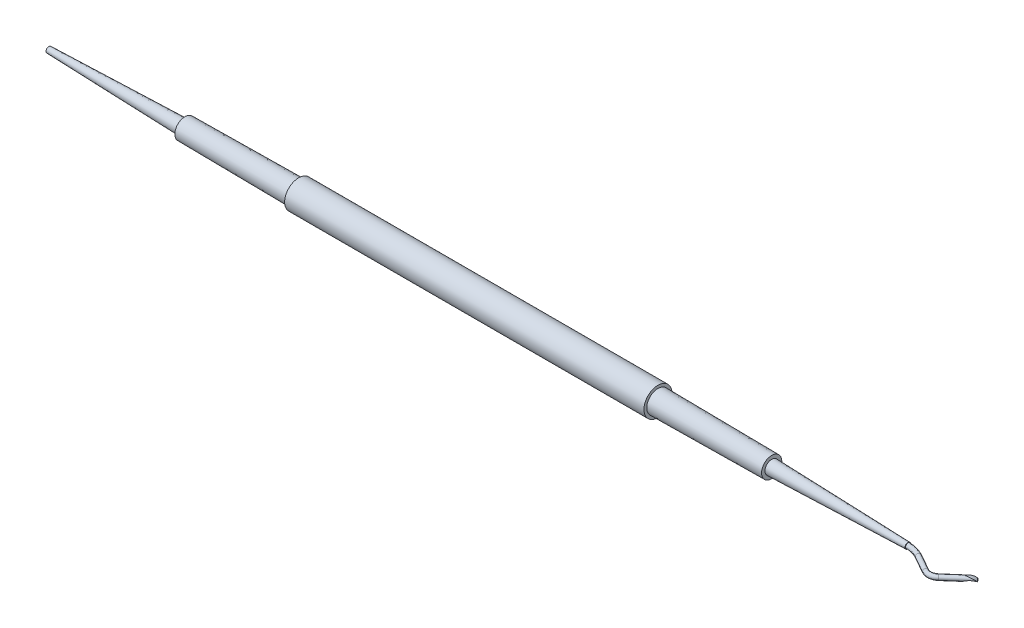
ISO-10303-21;
HEADER;
FILE_DESCRIPTION(('STEP AP214'),'2;1');
FILE_NAME('part.step','',(''),(''),'','','');
FILE_SCHEMA(('AUTOMOTIVE_DESIGN { 1 0 10303 214 1 1 1 1 }'));
ENDSEC;
DATA;
#1=APPLICATION_CONTEXT('core data for automotive mechanical design processes');
#2=APPLICATION_PROTOCOL_DEFINITION('international standard','automotive_design',2000,#1);
#3=PRODUCT_CONTEXT('',#1,'mechanical');
#4=PRODUCT('Part','Part','',(#3));
#5=PRODUCT_RELATED_PRODUCT_CATEGORY('part','',(#4));
#6=PRODUCT_DEFINITION_FORMATION('','',#4);
#7=PRODUCT_DEFINITION_CONTEXT('part definition',#1,'design');
#8=PRODUCT_DEFINITION('design','',#6,#7);
#9=PRODUCT_DEFINITION_SHAPE('','',#8);
#10=(LENGTH_UNIT() NAMED_UNIT(*) SI_UNIT(.MILLI.,.METRE.));
#11=(NAMED_UNIT(*) PLANE_ANGLE_UNIT() SI_UNIT($,.RADIAN.));
#12=(NAMED_UNIT(*) SI_UNIT($,.STERADIAN.) SOLID_ANGLE_UNIT());
#13=UNCERTAINTY_MEASURE_WITH_UNIT(LENGTH_MEASURE(1.E-05),#10,'distance_accuracy_value','');
#14=(GEOMETRIC_REPRESENTATION_CONTEXT(3) GLOBAL_UNCERTAINTY_ASSIGNED_CONTEXT((#13)) GLOBAL_UNIT_ASSIGNED_CONTEXT((#10,
#11,#12)) REPRESENTATION_CONTEXT('',''));
#15=CARTESIAN_POINT('',(0.,0.,0.));
#16=DIRECTION('',(0.,0.,1.));
#17=DIRECTION('',(1.,0.,0.));
#18=AXIS2_PLACEMENT_3D('',#15,#16,#17);
#19=CARTESIAN_POINT('',(63.6969930566618,0.,-30.1608804847367));
#20=DIRECTION('',(0.707106781186546,5.9604644836623E-08,-0.707106781186546));
#21=DIRECTION('',(-0.707106781186548,0.,-0.707106781186548));
#22=AXIS2_PLACEMENT_3D('',#19,#20,#21);
#23=CIRCLE('',#22,0.425000000000001);
#24=DIRECTION('',(0.752843126221306,0.,-0.658199990353487));
#25=VECTOR('',#24,1.);
#26=SURFACE_OF_LINEAR_EXTRUSION('',#23,#25);
#27=CARTESIAN_POINT('',(63.3964726746575,0.,-30.4614008667409));
#28=VERTEX_POINT('',#27);
#29=EDGE_CURVE('E175',#28,#28,#23,.T.);
#30=ORIENTED_EDGE('',*,*,#29,.T.);
#31=EDGE_LOOP('',(#30));
#32=FACE_BOUND('',#31,.T.);
#33=CARTESIAN_POINT('',(67.6511873969928,-0.258658752841257,-33.1710451259865));
#34=CARTESIAN_POINT('',(67.6528045494839,-0.24429116295213,-33.1579142887532));
#35=CARTESIAN_POINT('',(67.6535727690092,-0.229456959110943,-33.1453880770501));
#36=CARTESIAN_POINT('',(67.653411342128,-0.198855323524447,-33.1215449047044));
#37=CARTESIAN_POINT('',(67.6524816957216,-0.183087891779138,-33.1102279440617));
#38=CARTESIAN_POINT('',(67.6507031163494,-0.166853846081768,-33.0995156089493));
#39=B_SPLINE_CURVE_WITH_KNOTS('',3,(#33,#34,#35,#36,#37,#38),.UNSPECIFIED.,.F.,.F.,(4,2,4),(0.,
0.0582919179667387,0.116583835933478),.UNSPECIFIED.);
#40=CARTESIAN_POINT('',(67.6511873969928,-0.258658752841257,-33.1710451259865));
#41=VERTEX_POINT('',#40);
#42=CARTESIAN_POINT('',(67.6507031163494,-0.166853846081765,-33.0995156089493));
#43=VERTEX_POINT('',#42);
#44=EDGE_CURVE('E48',#41,#43,#39,.T.);
#45=ORIENTED_EDGE('',*,*,#44,.T.);
#46=CARTESIAN_POINT('',(67.6507031163494,-0.166853846081757,-33.0995156089493));
#47=CARTESIAN_POINT('',(67.6437455442857,-0.156078227115985,-33.08733965316));
#48=CARTESIAN_POINT('',(67.6362743139802,-0.145346648935356,-33.07543088082));
#49=CARTESIAN_POINT('',(67.6204099658853,-0.124034160674299,-33.0521217833227));
#50=CARTESIAN_POINT('',(67.6120175476423,-0.113453143063015,-33.0407210814638));
#51=CARTESIAN_POINT('',(67.5875937174699,-0.0843793389244943,-33.0097447208781));
#52=CARTESIAN_POINT('',(67.5706749068561,-0.0660976993231702,-32.990667082251));
#53=CARTESIAN_POINT('',(67.5346907839806,-0.0303530884627027,-32.953796697354));
#54=CARTESIAN_POINT('',(67.5156235172787,-0.0128908834262404,-32.9360051455755));
#55=CARTESIAN_POINT('',(67.4558715775179,0.0379787119219545,-32.8844072292486));
#56=CARTESIAN_POINT('',(67.4125398571444,0.0699805907076151,-32.8522626271264));
#57=CARTESIAN_POINT('',(67.3210207243787,0.129735904654552,-32.7913984281136));
#58=CARTESIAN_POINT('',(67.2728372215585,0.15749271577668,-32.7626761136504));
#59=CARTESIAN_POINT('',(67.1729461661692,0.208757610183487,-32.7077879807982));
#60=CARTESIAN_POINT('',(67.1212401551242,0.232267535755102,-32.6816210561623));
#61=CARTESIAN_POINT('',(67.0152664141436,0.275107483525564,-32.6312127860484));
#62=CARTESIAN_POINT('',(66.9609993363274,0.294438562854347,-32.6069709545602));
#63=CARTESIAN_POINT('',(66.8506006968685,0.329027529275209,-32.5599202414545));
#64=CARTESIAN_POINT('',(66.7944694239258,0.344286043791555,-32.5371111395235));
#65=CARTESIAN_POINT('',(66.6808786659113,0.370828459307692,-32.4925549487387));
#66=CARTESIAN_POINT('',(66.6234193071219,0.382112736559233,-32.4708077595188));
#67=CARTESIAN_POINT('',(66.5062091594492,0.401011375293602,-32.4275514743997));
#68=CARTESIAN_POINT('',(66.4464364163068,0.408531676929487,-32.4060604617622));
#69=CARTESIAN_POINT('',(66.3679282345576,0.41572425609031,-32.3785891610623));
#70=CARTESIAN_POINT('',(66.3494924808867,0.417221578234038,-32.3721921573082));
#71=CARTESIAN_POINT('',(66.3125454844976,0.419839639900346,-32.3595421650755));
#72=CARTESIAN_POINT('',(66.2940342456117,0.420960398306228,-32.3532891693901));
#73=CARTESIAN_POINT('',(66.2636425512783,0.42248601501354,-32.3433443001972));
#74=CARTESIAN_POINT('',(66.2518026655252,0.423002942848195,-32.3395491143053));
#75=CARTESIAN_POINT('',(66.2323990359157,0.42372120317685,-32.3336754765893));
#76=CARTESIAN_POINT('',(66.2248715356617,0.423968575195228,-32.3314807946055));
#77=CARTESIAN_POINT('',(66.2123507132798,0.424326063527001,-32.3281683299119));
#78=CARTESIAN_POINT('',(66.2073905551131,0.424453942341993,-32.3269421468421));
#79=CARTESIAN_POINT('',(66.1990931601383,0.424643061234417,-32.3252475693451));
#80=CARTESIAN_POINT('',(66.1957766236008,0.424712186131435,-32.324663234684));
#81=CARTESIAN_POINT('',(66.1891855006548,0.424834964550152,-32.3238696410187));
#82=CARTESIAN_POINT('',(66.1859140974136,0.424889105592861,-32.323646991518));
#83=CARTESIAN_POINT('',(66.1814748726344,0.424948121658036,-32.3241494061104));
#84=CARTESIAN_POINT('',(66.1802669068749,0.424962669605739,-32.324370237));
#85=CARTESIAN_POINT('',(66.1779226235479,0.424986089391464,-32.3251535324298));
#86=CARTESIAN_POINT('',(66.1767872134721,0.424994898672586,-32.3257196359968));
#87=CARTESIAN_POINT('',(66.1751563812516,0.425000793818929,-32.3270949986066));
#88=CARTESIAN_POINT('',(66.1745707888271,0.425000460160245,-32.3277927311136));
#89=CARTESIAN_POINT('',(66.1736673073348,0.424994359684992,-32.3293328655104));
#90=CARTESIAN_POINT('',(66.1733484062992,0.424988613584307,-32.3301747057859));
#91=CARTESIAN_POINT('',(66.1727155492817,0.42496713263638,-32.3326515426011));
#92=CARTESIAN_POINT('',(66.172648457182,0.424947056848973,-32.3343379718675));
#93=CARTESIAN_POINT('',(66.1728723287709,0.424877894302242,-32.3394063916986));
#94=CARTESIAN_POINT('',(66.1736066208746,0.424820308891583,-32.3427335956496));
#95=CARTESIAN_POINT('',(66.1754001750184,0.424691350473712,-32.3493117416951));
#96=CARTESIAN_POINT('',(66.1764627017238,0.424619841751555,-32.3525615474696));
#97=CARTESIAN_POINT('',(66.1798451387075,0.424389906937479,-32.3620948741987));
#98=CARTESIAN_POINT('',(66.1823935459102,0.42421390184582,-32.3682983355549));
#99=CARTESIAN_POINT('',(66.187683162078,0.423817070036864,-32.3806211981264));
#100=CARTESIAN_POINT('',(66.1904246135467,0.42359618626183,-32.3867404816386));
#101=CARTESIAN_POINT('',(66.1959969041315,0.423111527548993,-32.3988896795957));
#102=CARTESIAN_POINT('',(66.1988270402961,0.422848042969012,-32.4049199168643));
#103=CARTESIAN_POINT('',(66.2045443914714,0.422277550581856,-32.4169460955671));
#104=CARTESIAN_POINT('',(66.2074315715549,0.421970568737712,-32.4229420552562));
#105=CARTESIAN_POINT('',(66.2219631619519,0.420325503979314,-32.4528953249947));
#106=CARTESIAN_POINT('',(66.2338650061401,0.418659760019526,-32.4767107237203));
#107=CARTESIAN_POINT('',(66.2578395314483,0.414627654725028,-32.5242035675893));
#108=CARTESIAN_POINT('',(66.2699122693541,0.412261055041607,-32.5478809630024));
#109=CARTESIAN_POINT('',(66.2942088179677,0.406819375520685,-32.5951311620099));
#110=CARTESIAN_POINT('',(66.3064328597344,0.40374303949088,-32.6187037037108));
#111=CARTESIAN_POINT('',(66.3309943941912,0.396880683550806,-32.6656818919974));
#112=CARTESIAN_POINT('',(66.3433318762392,0.393094729578351,-32.6890875538801));
#113=CARTESIAN_POINT('',(66.3804659430073,0.38068550605793,-32.7588984901474));
#114=CARTESIAN_POINT('',(66.4054478021747,0.370996653728389,-32.8050218097191));
#115=CARTESIAN_POINT('',(66.4560308067797,0.348725398149464,-32.8962219659259));
#116=CARTESIAN_POINT('',(66.4816319822873,0.336142854147587,-32.9412987515388));
#117=CARTESIAN_POINT('',(66.5337036377941,0.307989507963047,-33.0301650803742));
#118=CARTESIAN_POINT('',(66.5601761406788,0.292411275751515,-33.0739511040906));
#119=CARTESIAN_POINT('',(66.6141500341152,0.258227406575446,-33.159665137125));
#120=CARTESIAN_POINT('',(66.6416512223902,0.239622362406729,-33.2015935082193));
#121=CARTESIAN_POINT('',(66.6979116412786,0.199368026463909,-33.2829544007512));
#122=CARTESIAN_POINT('',(66.72666831356,0.177724743033453,-33.3223916306471));
#123=CARTESIAN_POINT('',(66.7858422184484,0.131341943507186,-33.3981218761712));
#124=CARTESIAN_POINT('',(66.8162599087895,0.10660157148021,-33.4344140178924));
#125=CARTESIAN_POINT('',(66.8791911294972,0.0540883064027667,-33.5028364489158));
#126=CARTESIAN_POINT('',(66.9117056257442,0.0263140116479241,-33.534964799387));
#127=CARTESIAN_POINT('',(66.9749562987444,-0.0281961748381158,-33.5897805263988));
#128=CARTESIAN_POINT('',(67.0053752170644,-0.0545986506160452,-33.6131520876014));
#129=CARTESIAN_POINT('',(67.0530307302808,-0.09562398207578,-33.6441524944955));
#130=CARTESIAN_POINT('',(67.0694075219606,-0.109666427796053,-33.6538770488798));
#131=CARTESIAN_POINT('',(67.1028395377284,-0.138061412966175,-33.6716378723126));
#132=CARTESIAN_POINT('',(67.11989571802,-0.152414375476507,-33.6796716540989));
#133=CARTESIAN_POINT('',(67.137306241785,-0.166853846081759,-33.6867342563268));
#134=B_SPLINE_CURVE_WITH_KNOTS('',3,(#46,#47,#48,#49,#50,#51,#52,#53,#54,#55,#56,#57,#58,#59,
#60,#61,#62,#63,#64,#65,#66,#67,#68,#69,#70,#71,#72,#73,#74,#75,#76,#77,#78,#79,#80,#81,#82,#83,
#84,#85,#86,#87,#88,#89,#90,#91,#92,#93,#94,#95,#96,#97,#98,#99,#100,#101,#102,#103,#104,#105,
#106,#107,#108,#109,#110,#111,#112,#113,#114,#115,#116,#117,#118,#119,#120,#121,#122,#123,#124,
#125,#126,#127,#128,#129,#130,#131,#132,#133),.UNSPECIFIED.,.F.,.F.,(4,2,2,2,2,2,2,2,2,2,2,2,2,
2,2,2,2,2,2,2,2,2,2,2,2,2,2,2,2,2,2,2,2,2,2,2,2,2,2,2,2,2,2,4),(0.,0.0530330355999665,
0.106026073177627,0.200010813964857,0.294081753204683,0.481667918282324,0.669104117794824,
0.856458811727566,1.04376605461255,1.23104442403847,1.41830505854752,1.61003691416296,
1.66874862900401,1.72745739922639,1.76478323653067,1.78831905059973,1.80363450989081,
1.81375060771837,1.82348286278468,1.82714866496847,1.83085378731138,1.8335277001599,
1.83619142013251,1.84117821033633,1.85133505623803,1.8615963660805,1.88170022115322,
1.90182979757174,1.92182754977982,1.94181341544612,2.02182594460916,2.10186571593596,
2.18204825486523,2.26222334691014,2.42215353645507,2.58209150683444,2.74243140116676,
2.90273993093132,3.06273579142086,3.22277596741169,3.38289039891325,3.52221527905958,
3.5931408208341,3.66416998151407),.UNSPECIFIED.);
#135=CARTESIAN_POINT('',(67.137306241785,-0.166853846081765,-33.6867342563268));
#136=VERTEX_POINT('',#135);
#137=EDGE_CURVE('E11',#43,#136,#134,.T.);
#138=ORIENTED_EDGE('',*,*,#137,.T.);
#139=CARTESIAN_POINT('',(67.137306241785,-0.166853846081765,-33.6867342563268));
#140=CARTESIAN_POINT('',(67.1481601443111,-0.183087891771699,-33.6870663198518));
#141=CARTESIAN_POINT('',(67.1594998853307,-0.198855323513189,-33.6864763095287));
#142=CARTESIAN_POINT('',(67.1831510443566,-0.229456959099287,-33.6834521411864));
#143=CARTESIAN_POINT('',(67.195462462363,-0.244291162943894,-33.6810179831672));
#144=CARTESIAN_POINT('',(67.2082597188628,-0.258658752840058,-33.6776617512999));
#145=B_SPLINE_CURVE_WITH_KNOTS('',3,(#139,#140,#141,#142,#143,#144),.UNSPECIFIED.,.F.,.F.,(4,2,
4),(0.,0.0582919177986592,0.116583835597326),.UNSPECIFIED.);
#146=CARTESIAN_POINT('',(67.2082597188621,-0.258658752841257,-33.6776617512993));
#147=VERTEX_POINT('',#146);
#148=EDGE_CURVE('E95',#136,#147,#145,.T.);
#149=ORIENTED_EDGE('',*,*,#148,.T.);
#150=CARTESIAN_POINT('',(67.2082597188626,-0.258658752841215,-33.6776617512987));
#151=CARTESIAN_POINT('',(67.1802820012183,-0.245570495625067,-33.6664479209341));
#152=CARTESIAN_POINT('',(67.152771234666,-0.232928934422802,-33.6537098257842));
#153=CARTESIAN_POINT('',(67.0985946905032,-0.208753178425956,-33.625853853145));
#154=CARTESIAN_POINT('',(67.0719265347801,-0.197215637115919,-33.6107435594707));
#155=CARTESIAN_POINT('',(67.0052884862757,-0.169629940565738,-33.5703088847398));
#156=CARTESIAN_POINT('',(66.9657061785008,-0.15440439226653,-33.5437948069971));
#157=CARTESIAN_POINT('',(66.8873210973976,-0.127074523450579,-33.4879745468059));
#158=CARTESIAN_POINT('',(66.8485204574919,-0.114977895252638,-33.4586617212457));
#159=CARTESIAN_POINT('',(66.7711599088592,-0.0940022735049208,-33.3980789908946));
#160=CARTESIAN_POINT('',(66.7326032636704,-0.0851449739298108,-33.3667974785005));
#161=CARTESIAN_POINT('',(66.6557414659007,-0.0708179745754755,-33.3031420228818));
#162=CARTESIAN_POINT('',(66.6174364230336,-0.0653496666439142,-33.2707676365655));
#163=CARTESIAN_POINT('',(66.5410209775717,-0.0578366256922296,-33.205417244065));
#164=CARTESIAN_POINT('',(66.5029105301574,-0.0557910652641313,-33.1724413852286));
#165=CARTESIAN_POINT('',(66.4269694700037,-0.0551310684600747,-33.106161475021));
#166=CARTESIAN_POINT('',(66.3891387723274,-0.0565155438303682,-33.0728575310812));
#167=CARTESIAN_POINT('',(66.3067945706879,-0.0632993399987038,-32.9995950860713));
#168=CARTESIAN_POINT('',(66.2623868885887,-0.0694159464142125,-32.9595821945022));
#169=CARTESIAN_POINT('',(66.1750515064675,-0.0864580434115003,-32.8790154819311));
#170=CARTESIAN_POINT('',(66.1321227571341,-0.0973800454726768,-32.8384620739934));
#171=CARTESIAN_POINT('',(66.0637470241865,-0.119180382665745,-32.7708847367859));
#172=CARTESIAN_POINT('',(66.0375270206458,-0.128684226637528,-32.7441954607835));
#173=CARTESIAN_POINT('',(65.9866359410563,-0.149564266150504,-32.6901168330276));
#174=CARTESIAN_POINT('',(65.9619636384875,-0.160938952518723,-32.662728060466));
#175=CARTESIAN_POINT('',(65.9141966352896,-0.185735848511297,-32.6063023214763));
#176=CARTESIAN_POINT('',(65.8911490898595,-0.19919789163293,-32.5772422678051));
#177=CARTESIAN_POINT('',(65.8588658842258,-0.220625011124829,-32.5325200233485));
#178=CARTESIAN_POINT('',(65.848472883833,-0.227984529871102,-32.5174013662388));
#179=CARTESIAN_POINT('',(65.8286102466047,-0.243064632599637,-32.4867269959797));
#180=CARTESIAN_POINT('',(65.8191412781775,-0.250785472060949,-32.4711709767848));
#181=CARTESIAN_POINT('',(65.8102148753809,-0.258658752841249,-32.4553711167116));
#182=B_SPLINE_CURVE_WITH_KNOTS('',3,(#150,#151,#152,#153,#154,#155,#156,#157,#158,#159,#160,
#161,#162,#163,#164,#165,#166,#167,#168,#169,#170,#171,#172,#173,#174,#175,#176,#177,#178,#179,
#180,#181),.UNSPECIFIED.,.F.,.F.,(4,2,2,2,2,2,2,2,2,2,2,2,2,2,2,4),(0.,0.0984586315110298,
0.196608675093287,0.346424599443237,0.496605412468146,0.647774335110639,0.799005301258977,
0.9501997038587,1.10134614287648,1.28140305838815,1.46132947507233,1.57706667843567,
1.69271097263077,1.81092139927881,1.8701972529889,1.92951567153437),.UNSPECIFIED.);
#183=CARTESIAN_POINT('',(65.8102148753789,-0.258658752841257,-32.4553711167139));
#184=VERTEX_POINT('',#183);
#185=EDGE_CURVE('E84',#147,#184,#182,.T.);
#186=ORIENTED_EDGE('',*,*,#185,.T.);
#187=CARTESIAN_POINT('',(66.2900205884006,0.0674437386742544,-32.9840509806894));
#188=CARTESIAN_POINT('',(66.2643997822545,0.0527406776402467,-32.9647753499176));
#189=CARTESIAN_POINT('',(66.2392572877631,0.0380179738631719,-32.9448877289413));
#190=CARTESIAN_POINT('',(66.1899604255579,0.00855793825302269,-32.9039339439726));
#191=CARTESIAN_POINT('',(66.1658060489455,-0.00617939344709588,-32.8828677905974));
#192=CARTESIAN_POINT('',(66.0948363621088,-0.0503987428245335,-32.8179368447281));
#193=CARTESIAN_POINT('',(66.0495528481736,-0.0798660859064056,-32.7723684840827));
#194=CARTESIAN_POINT('',(65.9637472764439,-0.138524835060358,-32.6766973779446));
#195=CARTESIAN_POINT('',(65.9232265166547,-0.167716163925588,-32.6265934029051));
#196=CARTESIAN_POINT('',(65.8672156689508,-0.210983061157589,-32.5476996767273));
#197=CARTESIAN_POINT('',(65.8493275668627,-0.22533037593558,-32.520754873225));
#198=CARTESIAN_POINT('',(65.8155305379099,-0.253749559447364,-32.4655116066498));
#199=CARTESIAN_POINT('',(65.7996208546331,-0.267821531708544,-32.4372136666885));
#200=CARTESIAN_POINT('',(65.7703732126167,-0.29551805495409,-32.3791545991734));
#201=CARTESIAN_POINT('',(65.7570315929455,-0.309143219537263,-32.3493956315639));
#202=CARTESIAN_POINT('',(65.7338395709497,-0.335711879623463,-32.2881367808883));
#203=CARTESIAN_POINT('',(65.7239926978349,-0.348654674864151,-32.2566351748855));
#204=CARTESIAN_POINT('',(65.7122411175268,-0.36889849744288,-32.203188786204));
#205=CARTESIAN_POINT('',(65.7087631039807,-0.376589332624566,-32.1817555704411));
#206=CARTESIAN_POINT('',(65.70505406464,-0.391014155183455,-32.1383367907528));
#207=CARTESIAN_POINT('',(65.7048121490201,-0.397751276137085,-32.1163533288406));
#208=CARTESIAN_POINT('',(65.7092374067538,-0.410019190209617,-32.0707572691874));
#209=CARTESIAN_POINT('',(65.7142199457168,-0.415445102257521,-32.0471304973399));
#210=CARTESIAN_POINT('',(65.727368871278,-0.421147640296118,-32.013249085589));
#211=CARTESIAN_POINT('',(65.7327603495666,-0.42264424115994,-32.0021374339362));
#212=CARTESIAN_POINT('',(65.7455467762826,-0.424605743217495,-31.9810314250443));
#213=CARTESIAN_POINT('',(65.7529381911805,-0.425072450857632,-31.9710351407333));
#214=CARTESIAN_POINT('',(65.7682747598701,-0.424920644512247,-31.9539948980804));
#215=CARTESIAN_POINT('',(65.7759815758156,-0.424450602347291,-31.9467329817304));
#216=CARTESIAN_POINT('',(65.7923937396488,-0.422765058893588,-31.9335301134082));
#217=CARTESIAN_POINT('',(65.8011008786003,-0.421548202990423,-31.9275915886235));
#218=CARTESIAN_POINT('',(65.8332120102835,-0.416089949075966,-31.9088978203654));
#219=CARTESIAN_POINT('',(65.858471300073,-0.410084367578449,-31.8998495546026));
#220=CARTESIAN_POINT('',(65.9049295570339,-0.397187487354217,-31.8893236866796));
#221=CARTESIAN_POINT('',(65.9260597648345,-0.390638689784297,-31.8867930706796));
#222=CARTESIAN_POINT('',(65.9682192132868,-0.376651427702967,-31.8847868779945));
#223=CARTESIAN_POINT('',(65.9892480838433,-0.369210840083617,-31.8853187395949));
#224=CARTESIAN_POINT('',(66.0310946172084,-0.353710599862177,-31.8886694967027));
#225=CARTESIAN_POINT('',(66.0519080814141,-0.345645512863017,-31.8915111503584));
#226=CARTESIAN_POINT('',(66.0930731445994,-0.329143346677167,-31.8989518365643));
#227=CARTESIAN_POINT('',(66.1134244450131,-0.320706036833223,-31.9035519727274));
#228=CARTESIAN_POINT('',(66.1551239676478,-0.302946258973837,-31.9145366315719));
#229=CARTESIAN_POINT('',(66.1764353253044,-0.293604347142389,-31.921027564037));
#230=CARTESIAN_POINT('',(66.2185314052475,-0.274707727915836,-31.9353148888147));
#231=CARTESIAN_POINT('',(66.2393157820186,-0.265152888252404,-31.9431121133533));
#232=CARTESIAN_POINT('',(66.2806197882083,-0.245774169191445,-31.9598983138725));
#233=CARTESIAN_POINT('',(66.301133012435,-0.235948425967503,-31.9689007743332));
#234=CARTESIAN_POINT('',(66.3416187427822,-0.216195802040492,-31.9878583326351));
#235=CARTESIAN_POINT('',(66.3615920511617,-0.206269105423032,-31.9978119046214));
#236=CARTESIAN_POINT('',(66.3813224345087,-0.196302899475698,-32.0081738750472));
#237=B_SPLINE_CURVE_WITH_KNOTS('',3,(#187,#188,#189,#190,#191,#192,#193,#194,#195,#196,#197,
#198,#199,#200,#201,#202,#203,#204,#205,#206,#207,#208,#209,#210,#211,#212,#213,#214,#215,#216,
#217,#218,#219,#220,#221,#222,#223,#224,#225,#226,#227,#228,#229,#230,#231,#232,#233,#234,#235,
#236),.UNSPECIFIED.,.F.,.F.,(4,2,2,2,2,2,2,2,2,2,2,2,2,2,2,2,2,2,2,2,2,2,2,2,4),(0.,
0.105800013367014,0.211599073746606,0.42335518233639,0.635168868186571,0.741252056558328,
0.847294560454202,0.95318475615018,1.05918158401838,1.12810067102071,1.19678777915251,
1.26987354609439,1.30697977257714,1.34402086233903,1.37565481941378,1.40734632629246,
1.48817493544366,1.55476192449799,1.62151071118521,1.68892525560625,1.75638217863308,
1.8288037904344,1.90127171803265,1.97463140552348,2.04787531824744),.UNSPECIFIED.);
#238=CARTESIAN_POINT('',(66.2531425535137,-0.258658752839964,-31.9487544914006));
#239=VERTEX_POINT('',#238);
#240=EDGE_CURVE('E79',#184,#239,#237,.T.);
#241=ORIENTED_EDGE('',*,*,#240,.T.);
#242=CARTESIAN_POINT('',(66.2531425535109,-0.258658752841259,-31.9487544913995));
#243=CARTESIAN_POINT('',(66.2811184433904,-0.245571399606541,-31.959967516509));
#244=CARTESIAN_POINT('',(66.3086273031949,-0.232930675200975,-31.9727046470512));
#245=CARTESIAN_POINT('',(66.3628038557105,-0.208754769294081,-32.0005603195098));
#246=CARTESIAN_POINT('',(66.3894738223382,-0.197216387984019,-32.0156716098462));
#247=CARTESIAN_POINT('',(66.4565496326794,-0.169449581303954,-32.0563716825776));
#248=CARTESIAN_POINT('',(66.4965533551331,-0.154075043538436,-32.0831953281891));
#249=CARTESIAN_POINT('',(66.575712405549,-0.126537309497611,-32.1396410888984));
#250=CARTESIAN_POINT('',(66.6148668189258,-0.114377431288413,-32.1692660529494));
#251=CARTESIAN_POINT('',(66.6928782360191,-0.0933540311036968,-32.2304472531736));
#252=CARTESIAN_POINT('',(66.731732677842,-0.0845077676160026,-32.2620126305327));
#253=CARTESIAN_POINT('',(66.8091597111309,-0.070264007169429,-32.3262107512928));
#254=CARTESIAN_POINT('',(66.8477324070188,-0.0648651609243523,-32.3588430718391));
#255=CARTESIAN_POINT('',(66.9244309726151,-0.0575644709316384,-32.4244917271417));
#256=CARTESIAN_POINT('',(66.9625581039543,-0.0556394115744727,-32.4575040174097));
#257=CARTESIAN_POINT('',(67.0385471601704,-0.055224852727571,-32.5238677976532));
#258=CARTESIAN_POINT('',(67.0764090358043,-0.0567359750329596,-32.5572193479325));
#259=CARTESIAN_POINT('',(67.1515152029923,-0.063179548693823,-32.6241007622875));
#260=CARTESIAN_POINT('',(67.188760779109,-0.0681036186604254,-32.657629990292));
#261=CARTESIAN_POINT('',(67.2622922151856,-0.0813362454996726,-32.7250485198451));
#262=CARTESIAN_POINT('',(67.2985784407945,-0.0896434925044792,-32.7589376770996));
#263=CARTESIAN_POINT('',(67.3643181226703,-0.108110395649817,-32.8223153855905));
#264=CARTESIAN_POINT('',(67.3939876927776,-0.117813577685142,-32.8517124538313));
#265=CARTESIAN_POINT('',(67.4516090048666,-0.139556613334639,-32.9112445214609));
#266=CARTESIAN_POINT('',(67.4795629286306,-0.151593414680686,-32.9413785124799));
#267=CARTESIAN_POINT('',(67.5337538788533,-0.178229915766972,-33.0035976224143));
#268=CARTESIAN_POINT('',(67.5599294126721,-0.192886853271706,-33.0357128383802));
#269=CARTESIAN_POINT('',(67.5964782709941,-0.216441901454891,-33.0852532005328));
#270=CARTESIAN_POINT('',(67.6082289580632,-0.224572497867557,-33.1020284562832));
#271=CARTESIAN_POINT('',(67.6306067003276,-0.241290920635079,-33.1361161319714));
#272=CARTESIAN_POINT('',(67.6412327120094,-0.249879160692709,-33.153429031825));
#273=CARTESIAN_POINT('',(67.6511873969928,-0.258658752841244,-33.1710451259864));
#274=B_SPLINE_CURVE_WITH_KNOTS('',3,(#242,#243,#244,#245,#246,#247,#248,#249,#250,#251,#252,
#253,#254,#255,#256,#257,#258,#259,#260,#261,#262,#263,#264,#265,#266,#267,#268,#269,#270,#271,
#272,#273),.UNSPECIFIED.,.F.,.F.,(4,2,2,2,2,2,2,2,2,2,2,2,2,2,2,4),(0.,0.0984518700744764,
0.196608676476319,0.348045861753214,0.49963875058335,0.652010559137899,0.804322694208213,
0.955613090563104,1.10693086588861,1.25787835124327,1.40876744959418,1.53731251753577,
1.66569057503312,1.79732324045698,1.86339642234946,1.92953038155447),.UNSPECIFIED.);
#275=EDGE_CURVE('E90',#239,#41,#274,.T.);
#276=ORIENTED_EDGE('',*,*,#275,.T.);
#277=EDGE_LOOP('',(#45,#138,#149,#186,#241,#276));
#278=FACE_BOUND('',#277,.T.);
#279=ADVANCED_FACE('F33',(#32,#278),#26,.T.);
#280=CARTESIAN_POINT('',(58.6475548694359,0.,-31.6139719657644));
#281=DIRECTION('',(0.901142029145555,5.9604644836623E-08,0.433523982390164));
#282=DIRECTION('',(0.433523982390165,0.,-0.901142029145557));
#283=AXIS2_PLACEMENT_3D('',#280,#281,#282);
#284=CIRCLE('',#283,0.425000000000001);
#285=CARTESIAN_POINT('',(56.1007794856014,0.,-27.1178129547974));
#286=DIRECTION('',(0.,1.,0.));
#287=AXIS1_PLACEMENT('',#285,#286);
#288=SURFACE_OF_REVOLUTION('',#284,#287);
#289=CARTESIAN_POINT('',(58.8318025619517,0.,-31.9969573281512));
#290=VERTEX_POINT('',#289);
#291=EDGE_CURVE('E203',#290,#290,#284,.T.);
#292=ORIENTED_EDGE('',*,*,#291,.F.);
#293=EDGE_LOOP('',(#292));
#294=FACE_BOUND('',#293,.T.);
#295=CARTESIAN_POINT('',(56.1007794856014,0.424999999999832,-32.2851630296092));
#296=CARTESIAN_POINT('',(56.1007794856011,0.425020466931518,-32.3089851707164));
#297=CARTESIAN_POINT('',(56.1007794856012,0.42298934388977,-32.3328008363431));
#298=CARTESIAN_POINT('',(56.1007794856015,0.414975843758688,-32.379739218147));
#299=CARTESIAN_POINT('',(56.1007794856017,0.408996630670456,-32.4028624737228));
#300=CARTESIAN_POINT('',(56.1007794856016,0.393234996082388,-32.4477860774439));
#301=CARTESIAN_POINT('',(56.1007794856013,0.383450917837889,-32.4695858445181));
#302=CARTESIAN_POINT('',(56.1007794856014,0.360368864011758,-32.5112323237803));
#303=CARTESIAN_POINT('',(56.1007794856018,0.347071507258352,-32.5310793790746));
#304=CARTESIAN_POINT('',(56.1007794856018,0.317332419457146,-32.5682747619284));
#305=CARTESIAN_POINT('',(56.1007794856014,0.300889104998015,-32.5856218234591));
#306=CARTESIAN_POINT('',(56.1007794856014,0.265305386508557,-32.6173403888102));
#307=CARTESIAN_POINT('',(56.1007794856019,0.246161214362847,-32.6317076649913));
#308=CARTESIAN_POINT('',(56.1007794856019,0.205725235286263,-32.6570397917126));
#309=CARTESIAN_POINT('',(56.1007794856014,0.184432189205565,-32.6680026640743));
#310=CARTESIAN_POINT('',(56.1007794856014,0.140279707446608,-32.6862204462232));
#311=CARTESIAN_POINT('',(56.100779485602,0.117418101793713,-32.6934700968085));
#312=CARTESIAN_POINT('',(56.100779485602,0.0707998270538761,-32.7040355768036));
#313=CARTESIAN_POINT('',(56.1007794856014,0.0470430249886139,-32.7073508193751));
#314=CARTESIAN_POINT('',(56.1007794856014,-0.000730289591681288,-32.7099549002989));
#315=CARTESIAN_POINT('',(56.1007794856021,-0.0247471706640772,-32.7092369807506));
#316=CARTESIAN_POINT('',(56.1007794856021,-0.0723386801020896,-32.7037768917454));
#317=CARTESIAN_POINT('',(56.1007794856014,-0.0959129387659259,-32.6990314989222));
#318=CARTESIAN_POINT('',(56.1007794856014,-0.141889890360478,-32.6856570874754));
#319=CARTESIAN_POINT('',(56.1007794856021,-0.164294476776442,-32.6770345774357));
#320=CARTESIAN_POINT('',(56.1007794856023,-0.207363720162289,-32.6561374946616));
#321=CARTESIAN_POINT('',(56.1007794856016,-0.228026275491038,-32.6438585894021));
#322=CARTESIAN_POINT('',(56.1007794856011,-0.26696340876817,-32.6160191476977));
#323=CARTESIAN_POINT('',(56.1007794856013,-0.285241327540766,-32.6004632839121));
#324=CARTESIAN_POINT('',(56.1007794856014,-0.318921393184504,-32.5664988698903));
#325=CARTESIAN_POINT('',(56.1007794856014,-0.334323486251836,-32.5480902662939));
#326=CARTESIAN_POINT('',(56.1007794856014,-0.361789093969117,-32.5089701636934));
#327=CARTESIAN_POINT('',(56.1007794856014,-0.373857325728822,-32.488261977199));
#328=CARTESIAN_POINT('',(56.1007794856014,-0.394333141012377,-32.4451221750208));
#329=CARTESIAN_POINT('',(56.1007794856013,-0.402742481422613,-32.4226913925751));
#330=CARTESIAN_POINT('',(56.1007794856015,-0.415652014942598,-32.376762932385));
#331=CARTESIAN_POINT('',(56.1007794856019,-0.420158251242324,-32.3532669634518));
#332=CARTESIAN_POINT('',(56.1007794856019,-0.424222718212436,-32.314818299947));
#333=CARTESIAN_POINT('',(56.1007794856018,-0.425006370058467,-32.2999871531943));
#334=CARTESIAN_POINT('',(56.1007794856014,-0.424999999999832,-32.2851637866598));
#335=B_SPLINE_CURVE_WITH_KNOTS('',3,(#295,#296,#297,#298,#299,#300,#301,#302,#303,#304,#305,
#306,#307,#308,#309,#310,#311,#312,#313,#314,#315,#316,#317,#318,#319,#320,#321,#322,#323,#324,
#325,#326,#327,#328,#329,#330,#331,#332,#333,#334),.UNSPECIFIED.,.F.,.F.,(4,2,2,2,2,2,2,2,2,2,2,
2,2,2,2,2,2,2,2,4),(0.,0.0713706522130541,0.142684177259909,0.214028789040578,0.285360842562652,
0.356728893561818,0.428197517243004,0.49970759143964,0.571318670401143,0.6429404292023,
0.714682232011692,0.786481507184415,0.858160699068,0.929925165125219,1.00158798565507,
1.07325214679001,1.1448143841834,1.21634222158153,1.28775911318768,1.33222924739058),.UNSPECIFIED.);
#336=CARTESIAN_POINT('',(56.1007794856014,0.425,-32.2851630296093));
#337=VERTEX_POINT('',#336);
#338=CARTESIAN_POINT('',(56.1007794856014,-0.424999999999832,-32.2851637866599));
#339=VERTEX_POINT('',#338);
#340=EDGE_CURVE('E169',#337,#339,#335,.T.);
#341=ORIENTED_EDGE('',*,*,#340,.F.);
#342=CARTESIAN_POINT('',(56.1007794856014,0.,-32.2851634081347));
#343=DIRECTION('',(0.997758156276635,5.9604644836623E-08,-0.0669228031648955));
#344=DIRECTION('',(-0.0669228031648955,0.,-0.997758156276636));
#345=AXIS2_PLACEMENT_3D('',#342,#343,#344);
#346=CIRCLE('',#345,0.425000000000001);
#347=EDGE_CURVE('E205',#337,#339,#346,.T.);
#348=ORIENTED_EDGE('',*,*,#347,.T.);
#349=EDGE_LOOP('',(#341,#348));
#350=FACE_BOUND('',#349,.T.);
#351=ADVANCED_FACE('F35',(#294,#350),#288,.T.);
#352=CARTESIAN_POINT('',(56.1007794856014,0.,-32.2851634081347));
#353=DIRECTION('',(0.997758156276635,5.9604644836623E-08,-0.0669228031648955));
#354=DIRECTION('',(-0.0669228031648955,0.,-0.997758156276636));
#355=AXIS2_PLACEMENT_3D('',#352,#353,#354);
#356=PLANE('',#355);
#357=DIRECTION('',(0.,0.999999999999603,8.90647761566945E-07));
#358=VECTOR('',#357,1.);
#359=CARTESIAN_POINT('',(56.1007794856014,0.,-32.2851634081346));
#360=LINE('',#359,#358);
#361=EDGE_CURVE('E61',#339,#337,#360,.T.);
#362=ORIENTED_EDGE('',*,*,#361,.F.);
#363=ORIENTED_EDGE('',*,*,#347,.F.);
#364=EDGE_LOOP('',(#362,#363));
#365=FACE_BOUND('',#364,.T.);
#366=ADVANCED_FACE('F167',(#365),#356,.F.);
#367=CARTESIAN_POINT('',(61.5915639375064,0.,-29.9463864097244));
#368=DIRECTION('',(0.901142029145555,5.9604644836623E-08,0.433523982390164));
#369=DIRECTION('',(0.433523982390165,0.,-0.901142029145557));
#370=AXIS2_PLACEMENT_3D('',#367,#368,#369);
#371=CIRCLE('',#370,0.425000000000001);
#372=DIRECTION('',(-0.870109169402895,0.,-0.492859040011447));
#373=VECTOR('',#372,1.);
#374=SURFACE_OF_LINEAR_EXTRUSION('',#371,#373);
#375=CARTESIAN_POINT('',(61.7758116300222,0.,-30.3293717721112));
#376=VERTEX_POINT('',#375);
#377=EDGE_CURVE('E181',#376,#376,#371,.T.);
#378=ORIENTED_EDGE('',*,*,#377,.F.);
#379=EDGE_LOOP('',(#378));
#380=FACE_BOUND('',#379,.T.);
#381=ORIENTED_EDGE('',*,*,#291,.T.);
#382=EDGE_LOOP('',(#381));
#383=FACE_BOUND('',#382,.T.);
#384=ADVANCED_FACE('F185',(#380,#383),#374,.F.);
#385=CARTESIAN_POINT('',(62.4930639884204,0.,-31.5379235366467));
#386=DIRECTION('',(0.,-1.,0.));
#387=AXIS1_PLACEMENT('',#385,#386);
#388=SURFACE_OF_REVOLUTION('',#23,#387);
#389=ORIENTED_EDGE('',*,*,#29,.F.);
#390=EDGE_LOOP('',(#389));
#391=FACE_BOUND('',#390,.T.);
#392=ORIENTED_EDGE('',*,*,#377,.T.);
#393=EDGE_LOOP('',(#392));
#394=FACE_BOUND('',#393,.T.);
#395=ADVANCED_FACE('F165',(#391,#394),#388,.T.);
#396=CARTESIAN_POINT('',(56.1007794856014,0.,-32.2851634081347));
#397=DIRECTION('',(-1.,0.,0.));
#398=DIRECTION('',(0.,0.,1.));
#399=AXIS2_PLACEMENT_3D('',#396,#397,#398);
#400=PLANE('',#399);
#401=CARTESIAN_POINT('',(56.1007794856014,0.,-32.2851634081347));
#402=DIRECTION('',(1.,0.,0.));
#403=DIRECTION('',(0.,0.,-1.));
#404=AXIS2_PLACEMENT_3D('',#401,#402,#403);
#405=CIRCLE('',#404,0.500000000000021);
#406=CARTESIAN_POINT('',(56.1007794856014,0.,-32.7851634081347));
#407=VERTEX_POINT('',#406);
#408=EDGE_CURVE('E176',#407,#407,#405,.T.);
#409=ORIENTED_EDGE('',*,*,#408,.T.);
#410=EDGE_LOOP('',(#409));
#411=FACE_BOUND('',#410,.T.);
#412=ORIENTED_EDGE('',*,*,#361,.T.);
#413=ORIENTED_EDGE('',*,*,#340,.T.);
#414=EDGE_LOOP('',(#412,#413));
#415=FACE_BOUND('',#414,.T.);
#416=ADVANCED_FACE('F161',(#411,#415),#400,.F.);
#417=CARTESIAN_POINT('',(31.8502314966675,0.,-32.2851634081347));
#418=DIRECTION('',(-1.,0.,0.));
#419=DIRECTION('',(0.,0.,1.));
#420=AXIS2_PLACEMENT_3D('',#417,#418,#419);
#421=CONICAL_SURFACE('',#420,1.20000000000002,0.0288573141713058);
#422=ORIENTED_EDGE('',*,*,#408,.F.);
#423=EDGE_LOOP('',(#422));
#424=FACE_BOUND('',#423,.T.);
#425=CARTESIAN_POINT('',(31.8502314966675,0.,-32.2851634081347));
#426=DIRECTION('',(1.,0.,0.));
#427=DIRECTION('',(0.,0.,-1.));
#428=AXIS2_PLACEMENT_3D('',#425,#426,#427);
#429=CIRCLE('',#428,1.20000000000002);
#430=CARTESIAN_POINT('',(31.8502314966675,0.,-33.4851634081347));
#431=VERTEX_POINT('',#430);
#432=EDGE_CURVE('E361',#431,#431,#429,.T.);
#433=ORIENTED_EDGE('',*,*,#432,.T.);
#434=EDGE_LOOP('',(#433));
#435=FACE_BOUND('',#434,.T.);
#436=ADVANCED_FACE('F157',(#424,#435),#421,.T.);
#437=CARTESIAN_POINT('',(31.8502314966675,0.,-31.0851634081347));
#438=DIRECTION('',(-1.,0.,0.));
#439=DIRECTION('',(0.,0.,1.));
#440=AXIS2_PLACEMENT_3D('',#437,#438,#439);
#441=PLANE('',#440);
#442=ORIENTED_EDGE('',*,*,#432,.F.);
#443=EDGE_LOOP('',(#442));
#444=FACE_BOUND('',#443,.T.);
#445=CARTESIAN_POINT('',(31.8502314966675,0.,-32.2851634081347));
#446=DIRECTION('',(1.,0.,0.));
#447=DIRECTION('',(0.,0.,-1.));
#448=AXIS2_PLACEMENT_3D('',#445,#446,#447);
#449=CIRCLE('',#448,1.80000000000002);
#450=CARTESIAN_POINT('',(31.8502314966675,0.,-34.0851634081347));
#451=VERTEX_POINT('',#450);
#452=EDGE_CURVE('E359',#451,#451,#449,.T.);
#453=ORIENTED_EDGE('',*,*,#452,.T.);
#454=EDGE_LOOP('',(#453));
#455=FACE_BOUND('',#454,.T.);
#456=ADVANCED_FACE('F153',(#444,#455),#441,.F.);
#457=CARTESIAN_POINT('',(11.5916478874554,0.,-32.2851634081347));
#458=DIRECTION('',(-1.,0.,0.));
#459=DIRECTION('',(0.,0.,1.));
#460=AXIS2_PLACEMENT_3D('',#457,#458,#459);
#461=CONICAL_SURFACE('',#460,2.00000000000003,0.00987203778278252);
#462=ORIENTED_EDGE('',*,*,#452,.F.);
#463=EDGE_LOOP('',(#462));
#464=FACE_BOUND('',#463,.T.);
#465=CARTESIAN_POINT('',(11.5916478874554,0.,-32.2851634081347));
#466=DIRECTION('',(1.,0.,0.));
#467=DIRECTION('',(0.,0.,-1.));
#468=AXIS2_PLACEMENT_3D('',#465,#466,#467);
#469=CIRCLE('',#468,2.00000000000003);
#470=CARTESIAN_POINT('',(11.5916478874554,0.,-34.2851634081347));
#471=VERTEX_POINT('',#470);
#472=EDGE_CURVE('E356',#471,#471,#469,.T.);
#473=ORIENTED_EDGE('',*,*,#472,.T.);
#474=EDGE_LOOP('',(#473));
#475=FACE_BOUND('',#474,.T.);
#476=ADVANCED_FACE('F149',(#464,#475),#461,.T.);
#477=CARTESIAN_POINT('',(11.5916478874554,0.,-30.2851634081347));
#478=DIRECTION('',(-1.,0.,0.));
#479=DIRECTION('',(0.,0.,1.));
#480=AXIS2_PLACEMENT_3D('',#477,#478,#479);
#481=PLANE('',#480);
#482=ORIENTED_EDGE('',*,*,#472,.F.);
#483=EDGE_LOOP('',(#482));
#484=FACE_BOUND('',#483,.T.);
#485=CARTESIAN_POINT('',(11.5916478874554,0.,-32.2851634081347));
#486=DIRECTION('',(1.,0.,0.));
#487=DIRECTION('',(0.,0.,-1.));
#488=AXIS2_PLACEMENT_3D('',#485,#486,#487);
#489=CIRCLE('',#488,2.50000000000003);
#490=CARTESIAN_POINT('',(11.5916478874554,0.,-34.7851634081347));
#491=VERTEX_POINT('',#490);
#492=EDGE_CURVE('E353',#491,#491,#489,.T.);
#493=ORIENTED_EDGE('',*,*,#492,.T.);
#494=EDGE_LOOP('',(#493));
#495=FACE_BOUND('',#494,.T.);
#496=ADVANCED_FACE('F145',(#484,#495),#481,.F.);
#497=CARTESIAN_POINT('',(11.5916478874554,0.,-32.2851634081347));
#498=DIRECTION('',(1.,0.,0.));
#499=DIRECTION('',(0.,0.,-1.));
#500=AXIS2_PLACEMENT_3D('',#497,#498,#499);
#501=CYLINDRICAL_SURFACE('',#500,2.50000000000003);
#502=ORIENTED_EDGE('',*,*,#492,.F.);
#503=EDGE_LOOP('',(#502));
#504=FACE_BOUND('',#503,.T.);
#505=CARTESIAN_POINT('',(-52.4083521125446,0.,-32.2851634081347));
#506=DIRECTION('',(1.,0.,0.));
#507=DIRECTION('',(0.,0.,-1.));
#508=AXIS2_PLACEMENT_3D('',#505,#506,#507);
#509=CIRCLE('',#508,2.50000000000003);
#510=CARTESIAN_POINT('',(-52.4083521125446,0.,-34.7851634081347));
#511=VERTEX_POINT('',#510);
#512=EDGE_CURVE('E350',#511,#511,#509,.T.);
#513=ORIENTED_EDGE('',*,*,#512,.T.);
#514=EDGE_LOOP('',(#513));
#515=FACE_BOUND('',#514,.T.);
#516=ADVANCED_FACE('F141',(#504,#515),#501,.T.);
#517=CARTESIAN_POINT('',(-52.4083521125446,0.,-30.2851634081347));
#518=DIRECTION('',(1.,0.,0.));
#519=DIRECTION('',(0.,0.,-1.));
#520=AXIS2_PLACEMENT_3D('',#517,#518,#519);
#521=PLANE('',#520);
#522=ORIENTED_EDGE('',*,*,#512,.F.);
#523=EDGE_LOOP('',(#522));
#524=FACE_BOUND('',#523,.T.);
#525=CARTESIAN_POINT('',(-52.4083521125446,0.,-32.2851634081347));
#526=DIRECTION('',(1.,0.,0.));
#527=DIRECTION('',(0.,0.,-1.));
#528=AXIS2_PLACEMENT_3D('',#525,#526,#527);
#529=CIRCLE('',#528,2.00000000000003);
#530=CARTESIAN_POINT('',(-52.4083521125446,0.,-34.2851634081347));
#531=VERTEX_POINT('',#530);
#532=EDGE_CURVE('E347',#531,#531,#529,.T.);
#533=ORIENTED_EDGE('',*,*,#532,.T.);
#534=EDGE_LOOP('',(#533));
#535=FACE_BOUND('',#534,.T.);
#536=ADVANCED_FACE('F137',(#524,#535),#521,.F.);
#537=CARTESIAN_POINT('',(-72.6669357217566,0.,-32.2851634081347));
#538=DIRECTION('',(1.,0.,0.));
#539=DIRECTION('',(0.,0.,-1.));
#540=AXIS2_PLACEMENT_3D('',#537,#538,#539);
#541=CONICAL_SURFACE('',#540,1.80000000000002,0.00987203778278252);
#542=ORIENTED_EDGE('',*,*,#532,.F.);
#543=EDGE_LOOP('',(#542));
#544=FACE_BOUND('',#543,.T.);
#545=CARTESIAN_POINT('',(-72.6669357217566,0.,-32.2851634081347));
#546=DIRECTION('',(1.,0.,0.));
#547=DIRECTION('',(0.,0.,-1.));
#548=AXIS2_PLACEMENT_3D('',#545,#546,#547);
#549=CIRCLE('',#548,1.80000000000002);
#550=CARTESIAN_POINT('',(-72.6669357217566,0.,-34.0851634081347));
#551=VERTEX_POINT('',#550);
#552=EDGE_CURVE('E344',#551,#551,#549,.T.);
#553=ORIENTED_EDGE('',*,*,#552,.T.);
#554=EDGE_LOOP('',(#553));
#555=FACE_BOUND('',#554,.T.);
#556=ADVANCED_FACE('F133',(#544,#555),#541,.T.);
#557=CARTESIAN_POINT('',(-72.6669357217567,0.,-31.0851634081347));
#558=DIRECTION('',(1.,0.,0.));
#559=DIRECTION('',(0.,0.,-1.));
#560=AXIS2_PLACEMENT_3D('',#557,#558,#559);
#561=PLANE('',#560);
#562=ORIENTED_EDGE('',*,*,#552,.F.);
#563=EDGE_LOOP('',(#562));
#564=FACE_BOUND('',#563,.T.);
#565=CARTESIAN_POINT('',(-72.6669357217566,0.,-32.2851634081347));
#566=DIRECTION('',(1.,0.,0.));
#567=DIRECTION('',(0.,0.,-1.));
#568=AXIS2_PLACEMENT_3D('',#565,#566,#567);
#569=CIRCLE('',#568,1.20000000000002);
#570=CARTESIAN_POINT('',(-72.6669357217566,0.,-33.4851634081347));
#571=VERTEX_POINT('',#570);
#572=EDGE_CURVE('E339',#571,#571,#569,.T.);
#573=ORIENTED_EDGE('',*,*,#572,.T.);
#574=EDGE_LOOP('',(#573));
#575=FACE_BOUND('',#574,.T.);
#576=ADVANCED_FACE('F129',(#564,#575),#561,.F.);
#577=CARTESIAN_POINT('',(-96.9174837106905,0.,-32.2851634081347));
#578=DIRECTION('',(1.,0.,0.));
#579=DIRECTION('',(0.,0.,-1.));
#580=AXIS2_PLACEMENT_3D('',#577,#578,#579);
#581=CONICAL_SURFACE('',#580,0.500000000000021,0.0288573141713058);
#582=ORIENTED_EDGE('',*,*,#572,.F.);
#583=EDGE_LOOP('',(#582));
#584=FACE_BOUND('',#583,.T.);
#585=CARTESIAN_POINT('',(-96.9174837106905,0.,-32.2851634081347));
#586=DIRECTION('',(1.,0.,0.));
#587=DIRECTION('',(0.,0.,-1.));
#588=AXIS2_PLACEMENT_3D('',#585,#586,#587);
#589=CIRCLE('',#588,0.500000000000021);
#590=CARTESIAN_POINT('',(-96.9174837106905,0.,-32.7851634081347));
#591=VERTEX_POINT('',#590);
#592=EDGE_CURVE('E336',#591,#591,#589,.T.);
#593=ORIENTED_EDGE('',*,*,#592,.T.);
#594=EDGE_LOOP('',(#593));
#595=FACE_BOUND('',#594,.T.);
#596=ADVANCED_FACE('F125',(#584,#595),#581,.T.);
#597=CARTESIAN_POINT('',(-96.9174837106905,0.,-32.2851634081347));
#598=DIRECTION('',(1.,0.,0.));
#599=DIRECTION('',(0.,0.,-1.));
#600=AXIS2_PLACEMENT_3D('',#597,#598,#599);
#601=PLANE('',#600);
#602=ORIENTED_EDGE('',*,*,#592,.F.);
#603=EDGE_LOOP('',(#602));
#604=FACE_BOUND('',#603,.T.);
#605=ADVANCED_FACE('F120',(#604),#601,.F.);
#606=CARTESIAN_POINT('',(60.4778012285078,-2.27794775501142,-39.9652178196747));
#607=DIRECTION('',(0.658199990353488,0.,0.752843126221305));
#608=DIRECTION('',(0.752843126221305,0.,-0.658199990353488));
#609=AXIS2_PLACEMENT_3D('',#606,#607,#608);
#610=CYLINDRICAL_SURFACE('',#609,2.22253436851529);
#611=DIRECTION('',(0.658199990353488,0.,0.752843126221305));
#612=VECTOR('',#611,1.);
#613=CARTESIAN_POINT('',(59.7787788067669,-0.258658752841257,-39.3540725023812));
#614=LINE('',#613,#612);
#615=EDGE_CURVE('E54',#184,#239,#614,.T.);
#616=ORIENTED_EDGE('',*,*,#615,.F.);
#617=ORIENTED_EDGE('',*,*,#185,.F.);
#618=DIRECTION('',(0.658199990353488,0.,0.752843126221305));
#619=VECTOR('',#618,1.);
#620=CARTESIAN_POINT('',(61.1768236502487,-0.258658752841257,-40.5763631369682));
#621=LINE('',#620,#619);
#622=EDGE_CURVE('E328',#147,#41,#621,.T.);
#623=ORIENTED_EDGE('',*,*,#622,.T.);
#624=ORIENTED_EDGE('',*,*,#275,.F.);
#625=EDGE_LOOP('',(#616,#617,#623,#624));
#626=FACE_BOUND('',#625,.T.);
#627=ADVANCED_FACE('F87',(#626),#610,.F.);
#628=CARTESIAN_POINT('',(61.1411047711471,-0.166853846081765,-40.5451346312394));
#629=DIRECTION('',(0.66880736613035,0.459117658356131,-0.584728725816824));
#630=DIRECTION('',(-0.658199990353488,0.,-0.752843126221305));
#631=AXIS2_PLACEMENT_3D('',#628,#629,#630);
#632=PLANE('',#631);
#633=ORIENTED_EDGE('',*,*,#622,.F.);
#634=ORIENTED_EDGE('',*,*,#148,.F.);
#635=DIRECTION('',(0.658199990353488,0.,0.752843126221305));
#636=VECTOR('',#635,1.);
#637=CARTESIAN_POINT('',(61.1411047711471,-0.166853846081765,-40.5451346312394));
#638=LINE('',#637,#636);
#639=EDGE_CURVE('E91',#136,#43,#638,.T.);
#640=ORIENTED_EDGE('',*,*,#639,.T.);
#641=ORIENTED_EDGE('',*,*,#44,.F.);
#642=EDGE_LOOP('',(#633,#634,#640,#641));
#643=FACE_BOUND('',#642,.T.);
#644=ADVANCED_FACE('F119',(#643),#632,.T.);
#645=CARTESIAN_POINT('',(59.8858354843532,-2.21762922784142,-39.4476706262138));
#646=DIRECTION('',(0.658199990353488,0.,0.752843126221305));
#647=DIRECTION('',(0.752843126221305,0.,-0.658199990353488));
#648=AXIS2_PLACEMENT_3D('',#645,#646,#647);
#649=CYLINDRICAL_SURFACE('',#648,2.64306789377923);
#650=ORIENTED_EDGE('',*,*,#639,.F.);
#651=ORIENTED_EDGE('',*,*,#137,.F.);
#652=EDGE_LOOP('',(#650,#651));
#653=FACE_BOUND('',#652,.T.);
#654=ADVANCED_FACE('F305',(#653),#649,.T.);
#655=CARTESIAN_POINT('',(59.7787788067669,-0.258658752841257,-39.3540725023812));
#656=DIRECTION('',(0.314515911044334,-0.908552430403625,-0.274976767941619));
#657=DIRECTION('',(0.94498060996461,0.327126346830874,0.));
#658=AXIS2_PLACEMENT_3D('',#655,#656,#657);
#659=PLANE('',#658);
#660=ORIENTED_EDGE('',*,*,#615,.T.);
#661=ORIENTED_EDGE('',*,*,#240,.F.);
#662=EDGE_LOOP('',(#660,#661));
#663=FACE_BOUND('',#662,.T.);
#664=ADVANCED_FACE('F80',(#663),#659,.T.);
#665=CLOSED_SHELL('',(#279,#351,#366,#384,#395,#416,#436,#456,#476,#496,#516,#536,#556,#576,
#596,#605,#627,#644,#654,#664));
#666=MANIFOLD_SOLID_BREP('B2',#665);
#667=ADVANCED_BREP_SHAPE_REPRESENTATION('',(#18,#666),#14);
#668=SHAPE_DEFINITION_REPRESENTATION(#9,#667);
ENDSEC;
END-ISO-10303-21;
